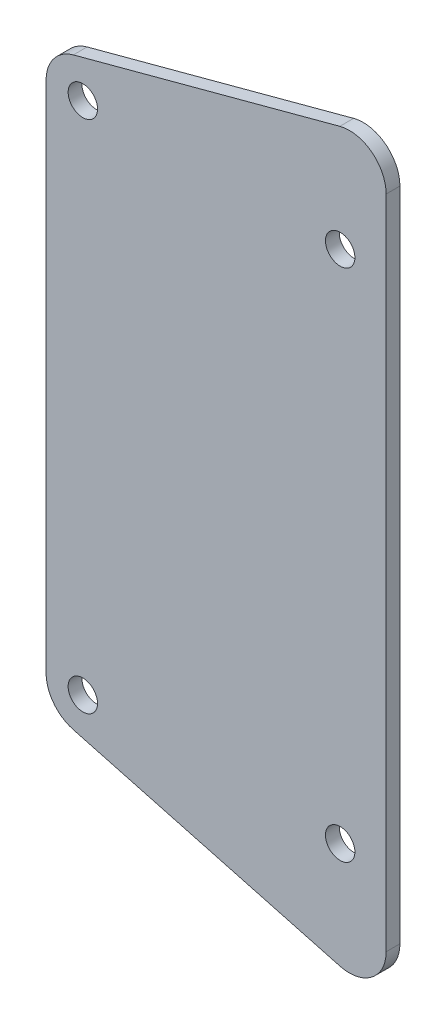
ISO-10303-21;
HEADER;
FILE_DESCRIPTION(('STEP AP214'),'2;1');
FILE_NAME('part.step','',(''),(''),'','','');
FILE_SCHEMA(('AUTOMOTIVE_DESIGN { 1 0 10303 214 1 1 1 1 }'));
ENDSEC;
DATA;
#1=APPLICATION_CONTEXT('core data for automotive mechanical design processes');
#2=APPLICATION_PROTOCOL_DEFINITION('international standard','automotive_design',2000,#1);
#3=PRODUCT_CONTEXT('',#1,'mechanical');
#4=PRODUCT('Part','Part','',(#3));
#5=PRODUCT_RELATED_PRODUCT_CATEGORY('part','',(#4));
#6=PRODUCT_DEFINITION_FORMATION('','',#4);
#7=PRODUCT_DEFINITION_CONTEXT('part definition',#1,'design');
#8=PRODUCT_DEFINITION('design','',#6,#7);
#9=PRODUCT_DEFINITION_SHAPE('','',#8);
#10=(LENGTH_UNIT() NAMED_UNIT(*) SI_UNIT(.MILLI.,.METRE.));
#11=(NAMED_UNIT(*) PLANE_ANGLE_UNIT() SI_UNIT($,.RADIAN.));
#12=(NAMED_UNIT(*) SI_UNIT($,.STERADIAN.) SOLID_ANGLE_UNIT());
#13=UNCERTAINTY_MEASURE_WITH_UNIT(LENGTH_MEASURE(1.E-05),#10,'distance_accuracy_value','');
#14=(GEOMETRIC_REPRESENTATION_CONTEXT(3) GLOBAL_UNCERTAINTY_ASSIGNED_CONTEXT((#13)) GLOBAL_UNIT_ASSIGNED_CONTEXT((#10,
#11,#12)) REPRESENTATION_CONTEXT('',''));
#15=CARTESIAN_POINT('',(0.,0.,0.));
#16=DIRECTION('',(0.,0.,1.));
#17=DIRECTION('',(1.,0.,0.));
#18=AXIS2_PLACEMENT_3D('',#15,#16,#17);
#19=CARTESIAN_POINT('',(0.,0.,1.5));
#20=DIRECTION('',(0.,0.,-1.));
#21=DIRECTION('',(-1.,0.,0.));
#22=AXIS2_PLACEMENT_3D('',#19,#20,#21);
#23=PLANE('',#22);
#24=DIRECTION('',(-0.965925826289067,-0.258819045102525,0.));
#25=VECTOR('',#24,1.);
#26=CARTESIAN_POINT('',(-32.,59.,1.5));
#27=LINE('',#26,#25);
#28=CARTESIAN_POINT('',(-0.0352761804100973,67.5649219337431,1.5));
#29=VERTEX_POINT('',#28);
#30=CARTESIAN_POINT('',(-29.0352761804101,59.7943953532404,1.5));
#31=VERTEX_POINT('',#30);
#32=EDGE_CURVE('E102',#29,#31,#27,.T.);
#33=ORIENTED_EDGE('',*,*,#32,.T.);
#34=CARTESIAN_POINT('',(-28.,55.9306920480842,1.5));
#35=DIRECTION('',(0.,0.,-1.));
#36=DIRECTION('',(-1.,0.,0.));
#37=AXIS2_PLACEMENT_3D('',#34,#35,#36);
#38=CIRCLE('',#37,4.);
#39=CARTESIAN_POINT('',(-32.,55.9306920480842,1.5));
#40=VERTEX_POINT('',#39);
#41=EDGE_CURVE('E97',#31,#40,#38,.F.);
#42=ORIENTED_EDGE('',*,*,#41,.T.);
#43=DIRECTION('',(0.,-1.,0.));
#44=VECTOR('',#43,1.);
#45=CARTESIAN_POINT('',(-32.,56.,1.5));
#46=LINE('',#45,#44);
#47=CARTESIAN_POINT('',(-32.,0.0693079519158216,1.5));
#48=VERTEX_POINT('',#47);
#49=EDGE_CURVE('E100',#40,#48,#46,.T.);
#50=ORIENTED_EDGE('',*,*,#49,.T.);
#51=CARTESIAN_POINT('',(-28.,0.0693079519158234,1.5));
#52=DIRECTION('',(0.,0.,-1.));
#53=DIRECTION('',(-1.,0.,0.));
#54=AXIS2_PLACEMENT_3D('',#51,#52,#53);
#55=CIRCLE('',#54,4.);
#56=CARTESIAN_POINT('',(-29.0352761804101,-3.79439535324044,1.5));
#57=VERTEX_POINT('',#56);
#58=EDGE_CURVE('E55',#48,#57,#55,.F.);
#59=ORIENTED_EDGE('',*,*,#58,.T.);
#60=DIRECTION('',(0.965925826289067,-0.258819045102525,0.));
#61=VECTOR('',#60,1.);
#62=CARTESIAN_POINT('',(-32.,-3.,1.5));
#63=LINE('',#62,#61);
#64=CARTESIAN_POINT('',(-0.0352761804101043,-11.5649219337431,1.5));
#65=VERTEX_POINT('',#64);
#66=EDGE_CURVE('E190',#57,#65,#63,.T.);
#67=ORIENTED_EDGE('',*,*,#66,.T.);
#68=CARTESIAN_POINT('',(0.999999999999997,-7.70121862858688,1.5));
#69=DIRECTION('',(0.,0.,-1.));
#70=DIRECTION('',(-1.,0.,0.));
#71=AXIS2_PLACEMENT_3D('',#68,#69,#70);
#72=CIRCLE('',#71,4.);
#73=CARTESIAN_POINT('',(5.,-7.70121862858688,1.5));
#74=VERTEX_POINT('',#73);
#75=EDGE_CURVE('E47',#65,#74,#72,.F.);
#76=ORIENTED_EDGE('',*,*,#75,.T.);
#77=DIRECTION('',(0.,1.,0.));
#78=VECTOR('',#77,1.);
#79=CARTESIAN_POINT('',(5.,59.,1.5));
#80=LINE('',#79,#78);
#81=CARTESIAN_POINT('',(5.,63.7012186285869,1.5));
#82=VERTEX_POINT('',#81);
#83=EDGE_CURVE('E117',#74,#82,#80,.T.);
#84=ORIENTED_EDGE('',*,*,#83,.T.);
#85=CARTESIAN_POINT('',(1.,63.7012186285869,1.5));
#86=DIRECTION('',(0.,0.,-1.));
#87=DIRECTION('',(-1.,0.,0.));
#88=AXIS2_PLACEMENT_3D('',#85,#86,#87);
#89=CIRCLE('',#88,4.);
#90=EDGE_CURVE('E136',#82,#29,#89,.F.);
#91=ORIENTED_EDGE('',*,*,#90,.T.);
#92=EDGE_LOOP('',(#33,#42,#50,#59,#67,#76,#84,#91));
#93=FACE_BOUND('',#92,.T.);
#94=CARTESIAN_POINT('',(0.,0.,1.5));
#95=DIRECTION('',(0.,0.,1.));
#96=DIRECTION('',(1.,0.,0.));
#97=AXIS2_PLACEMENT_3D('',#94,#95,#96);
#98=CIRCLE('',#97,1.6);
#99=CARTESIAN_POINT('',(1.6,0.,1.5));
#100=VERTEX_POINT('',#99);
#101=EDGE_CURVE('E159',#100,#100,#98,.T.);
#102=ORIENTED_EDGE('',*,*,#101,.F.);
#103=EDGE_LOOP('',(#102));
#104=FACE_BOUND('',#103,.T.);
#105=CARTESIAN_POINT('',(-28.,0.,1.5));
#106=DIRECTION('',(0.,0.,1.));
#107=DIRECTION('',(1.,0.,0.));
#108=AXIS2_PLACEMENT_3D('',#105,#106,#107);
#109=CIRCLE('',#108,1.6);
#110=CARTESIAN_POINT('',(-26.4,0.,1.5));
#111=VERTEX_POINT('',#110);
#112=EDGE_CURVE('E164',#111,#111,#109,.T.);
#113=ORIENTED_EDGE('',*,*,#112,.F.);
#114=EDGE_LOOP('',(#113));
#115=FACE_BOUND('',#114,.T.);
#116=CARTESIAN_POINT('',(0.,56.,1.5));
#117=DIRECTION('',(0.,0.,1.));
#118=DIRECTION('',(1.,0.,0.));
#119=AXIS2_PLACEMENT_3D('',#116,#117,#118);
#120=CIRCLE('',#119,1.6);
#121=CARTESIAN_POINT('',(1.6,56.,1.5));
#122=VERTEX_POINT('',#121);
#123=EDGE_CURVE('E169',#122,#122,#120,.T.);
#124=ORIENTED_EDGE('',*,*,#123,.F.);
#125=EDGE_LOOP('',(#124));
#126=FACE_BOUND('',#125,.T.);
#127=CARTESIAN_POINT('',(-28.,56.,1.5));
#128=DIRECTION('',(0.,0.,1.));
#129=DIRECTION('',(1.,0.,0.));
#130=AXIS2_PLACEMENT_3D('',#127,#128,#129);
#131=CIRCLE('',#130,1.6);
#132=CARTESIAN_POINT('',(-26.4,56.,1.5));
#133=VERTEX_POINT('',#132);
#134=EDGE_CURVE('E175',#133,#133,#131,.T.);
#135=ORIENTED_EDGE('',*,*,#134,.F.);
#136=EDGE_LOOP('',(#135));
#137=FACE_BOUND('',#136,.T.);
#138=ADVANCED_FACE('F32',(#93,#104,#115,#126,#137),#23,.F.);
#139=CARTESIAN_POINT('',(0.,0.,0.));
#140=DIRECTION('',(0.,0.,-1.));
#141=DIRECTION('',(-1.,0.,0.));
#142=AXIS2_PLACEMENT_3D('',#139,#140,#141);
#143=PLANE('',#142);
#144=DIRECTION('',(0.,-1.,0.));
#145=VECTOR('',#144,1.);
#146=CARTESIAN_POINT('',(-32.,0.,0.));
#147=LINE('',#146,#145);
#148=CARTESIAN_POINT('',(-32.,55.9306920480842,0.));
#149=VERTEX_POINT('',#148);
#150=CARTESIAN_POINT('',(-32.,0.0693079519158234,0.));
#151=VERTEX_POINT('',#150);
#152=EDGE_CURVE('E153',#149,#151,#147,.T.);
#153=ORIENTED_EDGE('',*,*,#152,.F.);
#154=CARTESIAN_POINT('',(-28.,55.9306920480842,0.));
#155=DIRECTION('',(0.,0.,-1.));
#156=DIRECTION('',(-1.,0.,0.));
#157=AXIS2_PLACEMENT_3D('',#154,#155,#156);
#158=CIRCLE('',#157,4.);
#159=CARTESIAN_POINT('',(-29.0352761804101,59.7943953532404,0.));
#160=VERTEX_POINT('',#159);
#161=EDGE_CURVE('E120',#149,#160,#158,.T.);
#162=ORIENTED_EDGE('',*,*,#161,.T.);
#163=DIRECTION('',(-0.965925826289067,-0.258819045102525,0.));
#164=VECTOR('',#163,1.);
#165=CARTESIAN_POINT('',(-32.,59.,0.));
#166=LINE('',#165,#164);
#167=CARTESIAN_POINT('',(-0.0352761804100973,67.5649219337431,0.));
#168=VERTEX_POINT('',#167);
#169=EDGE_CURVE('E181',#168,#160,#166,.T.);
#170=ORIENTED_EDGE('',*,*,#169,.F.);
#171=CARTESIAN_POINT('',(1.,63.7012186285869,0.));
#172=DIRECTION('',(0.,0.,-1.));
#173=DIRECTION('',(-1.,0.,0.));
#174=AXIS2_PLACEMENT_3D('',#171,#172,#173);
#175=CIRCLE('',#174,4.);
#176=CARTESIAN_POINT('',(5.,63.7012186285869,0.));
#177=VERTEX_POINT('',#176);
#178=EDGE_CURVE('E121',#168,#177,#175,.T.);
#179=ORIENTED_EDGE('',*,*,#178,.T.);
#180=DIRECTION('',(0.,1.,0.));
#181=VECTOR('',#180,1.);
#182=CARTESIAN_POINT('',(5.,59.,0.));
#183=LINE('',#182,#181);
#184=CARTESIAN_POINT('',(5.,-7.70121862858688,0.));
#185=VERTEX_POINT('',#184);
#186=EDGE_CURVE('E150',#185,#177,#183,.T.);
#187=ORIENTED_EDGE('',*,*,#186,.F.);
#188=CARTESIAN_POINT('',(0.999999999999997,-7.70121862858688,0.));
#189=DIRECTION('',(0.,0.,-1.));
#190=DIRECTION('',(-1.,0.,0.));
#191=AXIS2_PLACEMENT_3D('',#188,#189,#190);
#192=CIRCLE('',#191,4.);
#193=CARTESIAN_POINT('',(-0.0352761804100904,-11.5649219337432,0.));
#194=VERTEX_POINT('',#193);
#195=EDGE_CURVE('E123',#185,#194,#192,.T.);
#196=ORIENTED_EDGE('',*,*,#195,.T.);
#197=DIRECTION('',(0.965925826289067,-0.258819045102525,0.));
#198=VECTOR('',#197,1.);
#199=CARTESIAN_POINT('',(-32.,-3.,0.));
#200=LINE('',#199,#198);
#201=CARTESIAN_POINT('',(-29.0352761804101,-3.79439535324044,0.));
#202=VERTEX_POINT('',#201);
#203=EDGE_CURVE('E187',#202,#194,#200,.T.);
#204=ORIENTED_EDGE('',*,*,#203,.F.);
#205=CARTESIAN_POINT('',(-28.,0.0693079519158234,0.));
#206=DIRECTION('',(0.,0.,-1.));
#207=DIRECTION('',(-1.,0.,0.));
#208=AXIS2_PLACEMENT_3D('',#205,#206,#207);
#209=CIRCLE('',#208,4.);
#210=EDGE_CURVE('E129',#202,#151,#209,.T.);
#211=ORIENTED_EDGE('',*,*,#210,.T.);
#212=EDGE_LOOP('',(#153,#162,#170,#179,#187,#196,#204,#211));
#213=FACE_BOUND('',#212,.T.);
#214=CARTESIAN_POINT('',(0.,56.,0.));
#215=DIRECTION('',(0.,0.,1.));
#216=DIRECTION('',(1.,0.,0.));
#217=AXIS2_PLACEMENT_3D('',#214,#215,#216);
#218=CIRCLE('',#217,1.6);
#219=CARTESIAN_POINT('',(1.6,56.,0.));
#220=VERTEX_POINT('',#219);
#221=EDGE_CURVE('E172',#220,#220,#218,.T.);
#222=ORIENTED_EDGE('',*,*,#221,.T.);
#223=EDGE_LOOP('',(#222));
#224=FACE_BOUND('',#223,.T.);
#225=CARTESIAN_POINT('',(0.,0.,0.));
#226=DIRECTION('',(0.,0.,1.));
#227=DIRECTION('',(1.,0.,0.));
#228=AXIS2_PLACEMENT_3D('',#225,#226,#227);
#229=CIRCLE('',#228,1.6);
#230=CARTESIAN_POINT('',(1.6,0.,0.));
#231=VERTEX_POINT('',#230);
#232=EDGE_CURVE('E156',#231,#231,#229,.T.);
#233=ORIENTED_EDGE('',*,*,#232,.T.);
#234=EDGE_LOOP('',(#233));
#235=FACE_BOUND('',#234,.T.);
#236=CARTESIAN_POINT('',(-28.,0.,0.));
#237=DIRECTION('',(0.,0.,1.));
#238=DIRECTION('',(1.,0.,0.));
#239=AXIS2_PLACEMENT_3D('',#236,#237,#238);
#240=CIRCLE('',#239,1.6);
#241=CARTESIAN_POINT('',(-26.4,0.,0.));
#242=VERTEX_POINT('',#241);
#243=EDGE_CURVE('E166',#242,#242,#240,.T.);
#244=ORIENTED_EDGE('',*,*,#243,.T.);
#245=EDGE_LOOP('',(#244));
#246=FACE_BOUND('',#245,.T.);
#247=CARTESIAN_POINT('',(-28.,56.,0.));
#248=DIRECTION('',(0.,0.,1.));
#249=DIRECTION('',(1.,0.,0.));
#250=AXIS2_PLACEMENT_3D('',#247,#248,#249);
#251=CIRCLE('',#250,1.6);
#252=CARTESIAN_POINT('',(-26.4,56.,0.));
#253=VERTEX_POINT('',#252);
#254=EDGE_CURVE('E178',#253,#253,#251,.T.);
#255=ORIENTED_EDGE('',*,*,#254,.T.);
#256=EDGE_LOOP('',(#255));
#257=FACE_BOUND('',#256,.T.);
#258=ADVANCED_FACE('F199',(#213,#224,#235,#246,#257),#143,.T.);
#259=CARTESIAN_POINT('',(5.,59.,1.5));
#260=DIRECTION('',(-1.,0.,0.));
#261=DIRECTION('',(0.,0.,1.));
#262=AXIS2_PLACEMENT_3D('',#259,#260,#261);
#263=PLANE('',#262);
#264=ORIENTED_EDGE('',*,*,#83,.F.);
#265=DIRECTION('',(0.,0.,1.));
#266=VECTOR('',#265,1.);
#267=CARTESIAN_POINT('',(5.,-7.70121862858688,0.));
#268=LINE('',#267,#266);
#269=EDGE_CURVE('E11',#74,#185,#268,.F.);
#270=ORIENTED_EDGE('',*,*,#269,.T.);
#271=ORIENTED_EDGE('',*,*,#186,.T.);
#272=DIRECTION('',(0.,0.,1.));
#273=VECTOR('',#272,1.);
#274=CARTESIAN_POINT('',(5.,63.7012186285869,1.5));
#275=LINE('',#274,#273);
#276=EDGE_CURVE('E40',#177,#82,#275,.T.);
#277=ORIENTED_EDGE('',*,*,#276,.T.);
#278=EDGE_LOOP('',(#264,#270,#271,#277));
#279=FACE_BOUND('',#278,.T.);
#280=ADVANCED_FACE('F148',(#279),#263,.F.);
#281=CARTESIAN_POINT('',(-32.,0.,1.5));
#282=DIRECTION('',(1.,0.,0.));
#283=DIRECTION('',(0.,0.,-1.));
#284=AXIS2_PLACEMENT_3D('',#281,#282,#283);
#285=PLANE('',#284);
#286=ORIENTED_EDGE('',*,*,#49,.F.);
#287=DIRECTION('',(0.,0.,-1.));
#288=VECTOR('',#287,1.);
#289=CARTESIAN_POINT('',(-32.,55.9306920480842,0.));
#290=LINE('',#289,#288);
#291=EDGE_CURVE('E113',#40,#149,#290,.T.);
#292=ORIENTED_EDGE('',*,*,#291,.T.);
#293=ORIENTED_EDGE('',*,*,#152,.T.);
#294=DIRECTION('',(0.,0.,1.));
#295=VECTOR('',#294,1.);
#296=CARTESIAN_POINT('',(-32.,0.0693079519158234,1.5));
#297=LINE('',#296,#295);
#298=EDGE_CURVE('E116',#151,#48,#297,.T.);
#299=ORIENTED_EDGE('',*,*,#298,.T.);
#300=EDGE_LOOP('',(#286,#292,#293,#299));
#301=FACE_BOUND('',#300,.T.);
#302=ADVANCED_FACE('F111',(#301),#285,.F.);
#303=CARTESIAN_POINT('',(0.,0.,1.5));
#304=DIRECTION('',(0.,0.,-1.));
#305=DIRECTION('',(-1.,0.,0.));
#306=AXIS2_PLACEMENT_3D('',#303,#304,#305);
#307=CYLINDRICAL_SURFACE('',#306,1.6);
#308=ORIENTED_EDGE('',*,*,#101,.T.);
#309=EDGE_LOOP('',(#308));
#310=FACE_BOUND('',#309,.T.);
#311=ORIENTED_EDGE('',*,*,#232,.F.);
#312=EDGE_LOOP('',(#311));
#313=FACE_BOUND('',#312,.T.);
#314=ADVANCED_FACE('F226',(#310,#313),#307,.F.);
#315=CARTESIAN_POINT('',(-28.,0.,1.5));
#316=DIRECTION('',(0.,0.,-1.));
#317=DIRECTION('',(-1.,0.,0.));
#318=AXIS2_PLACEMENT_3D('',#315,#316,#317);
#319=CYLINDRICAL_SURFACE('',#318,1.6);
#320=ORIENTED_EDGE('',*,*,#112,.T.);
#321=EDGE_LOOP('',(#320));
#322=FACE_BOUND('',#321,.T.);
#323=ORIENTED_EDGE('',*,*,#243,.F.);
#324=EDGE_LOOP('',(#323));
#325=FACE_BOUND('',#324,.T.);
#326=ADVANCED_FACE('F306',(#322,#325),#319,.F.);
#327=CARTESIAN_POINT('',(0.,56.,1.5));
#328=DIRECTION('',(0.,0.,-1.));
#329=DIRECTION('',(-1.,0.,0.));
#330=AXIS2_PLACEMENT_3D('',#327,#328,#329);
#331=CYLINDRICAL_SURFACE('',#330,1.6);
#332=ORIENTED_EDGE('',*,*,#123,.T.);
#333=EDGE_LOOP('',(#332));
#334=FACE_BOUND('',#333,.T.);
#335=ORIENTED_EDGE('',*,*,#221,.F.);
#336=EDGE_LOOP('',(#335));
#337=FACE_BOUND('',#336,.T.);
#338=ADVANCED_FACE('F216',(#334,#337),#331,.F.);
#339=CARTESIAN_POINT('',(-28.,56.,1.5));
#340=DIRECTION('',(0.,0.,-1.));
#341=DIRECTION('',(-1.,0.,0.));
#342=AXIS2_PLACEMENT_3D('',#339,#340,#341);
#343=CYLINDRICAL_SURFACE('',#342,1.6);
#344=ORIENTED_EDGE('',*,*,#134,.T.);
#345=EDGE_LOOP('',(#344));
#346=FACE_BOUND('',#345,.T.);
#347=ORIENTED_EDGE('',*,*,#254,.F.);
#348=EDGE_LOOP('',(#347));
#349=FACE_BOUND('',#348,.T.);
#350=ADVANCED_FACE('F208',(#346,#349),#343,.F.);
#351=CARTESIAN_POINT('',(-32.,59.,-38.3052186751731));
#352=DIRECTION('',(-0.258819045102525,0.965925826289067,0.));
#353=DIRECTION('',(-0.965925826289067,-0.258819045102525,0.));
#354=AXIS2_PLACEMENT_3D('',#351,#352,#353);
#355=PLANE('',#354);
#356=ORIENTED_EDGE('',*,*,#169,.T.);
#357=DIRECTION('',(0.,0.,-1.));
#358=VECTOR('',#357,1.);
#359=CARTESIAN_POINT('',(-29.0352761804101,59.7943953532404,1.5));
#360=LINE('',#359,#358);
#361=EDGE_CURVE('E134',#160,#31,#360,.F.);
#362=ORIENTED_EDGE('',*,*,#361,.T.);
#363=ORIENTED_EDGE('',*,*,#32,.F.);
#364=DIRECTION('',(0.,0.,1.));
#365=VECTOR('',#364,1.);
#366=CARTESIAN_POINT('',(-0.0352761804101032,67.5649219337431,0.));
#367=LINE('',#366,#365);
#368=EDGE_CURVE('E132',#29,#168,#367,.F.);
#369=ORIENTED_EDGE('',*,*,#368,.T.);
#370=EDGE_LOOP('',(#356,#362,#363,#369));
#371=FACE_BOUND('',#370,.T.);
#372=ADVANCED_FACE('F206',(#371),#355,.T.);
#373=CARTESIAN_POINT('',(-32.,-3.,-38.3052186751731));
#374=DIRECTION('',(-0.258819045102525,-0.965925826289067,0.));
#375=DIRECTION('',(0.965925826289067,-0.258819045102525,0.));
#376=AXIS2_PLACEMENT_3D('',#373,#374,#375);
#377=PLANE('',#376);
#378=ORIENTED_EDGE('',*,*,#66,.F.);
#379=DIRECTION('',(0.,0.,1.));
#380=VECTOR('',#379,1.);
#381=CARTESIAN_POINT('',(-29.0352761804101,-3.79439535324044,0.));
#382=LINE('',#381,#380);
#383=EDGE_CURVE('E141',#57,#202,#382,.F.);
#384=ORIENTED_EDGE('',*,*,#383,.T.);
#385=ORIENTED_EDGE('',*,*,#203,.T.);
#386=DIRECTION('',(0.,0.,1.));
#387=VECTOR('',#386,1.);
#388=CARTESIAN_POINT('',(-0.0352761804101041,-11.5649219337431,1.5));
#389=LINE('',#388,#387);
#390=EDGE_CURVE('E106',#194,#65,#389,.T.);
#391=ORIENTED_EDGE('',*,*,#390,.T.);
#392=EDGE_LOOP('',(#378,#384,#385,#391));
#393=FACE_BOUND('',#392,.T.);
#394=ADVANCED_FACE('F193',(#393),#377,.T.);
#395=CARTESIAN_POINT('',(-28.,55.9306920480842,1.5));
#396=DIRECTION('',(0.,0.,1.));
#397=DIRECTION('',(1.,0.,0.));
#398=AXIS2_PLACEMENT_3D('',#395,#396,#397);
#399=CYLINDRICAL_SURFACE('',#398,4.);
#400=ORIENTED_EDGE('',*,*,#41,.F.);
#401=ORIENTED_EDGE('',*,*,#361,.F.);
#402=ORIENTED_EDGE('',*,*,#161,.F.);
#403=ORIENTED_EDGE('',*,*,#291,.F.);
#404=EDGE_LOOP('',(#400,#401,#402,#403));
#405=FACE_BOUND('',#404,.T.);
#406=ADVANCED_FACE('F119',(#405),#399,.T.);
#407=CARTESIAN_POINT('',(-28.,0.0693079519158234,1.5));
#408=DIRECTION('',(0.,0.,-1.));
#409=DIRECTION('',(-1.,0.,0.));
#410=AXIS2_PLACEMENT_3D('',#407,#408,#409);
#411=CYLINDRICAL_SURFACE('',#410,4.);
#412=ORIENTED_EDGE('',*,*,#210,.F.);
#413=ORIENTED_EDGE('',*,*,#383,.F.);
#414=ORIENTED_EDGE('',*,*,#58,.F.);
#415=ORIENTED_EDGE('',*,*,#298,.F.);
#416=EDGE_LOOP('',(#412,#413,#414,#415));
#417=FACE_BOUND('',#416,.T.);
#418=ADVANCED_FACE('F197',(#417),#411,.T.);
#419=CARTESIAN_POINT('',(0.999999999999997,-7.70121862858688,-38.3052186751731));
#420=DIRECTION('',(0.,0.,-1.));
#421=DIRECTION('',(-1.,0.,0.));
#422=AXIS2_PLACEMENT_3D('',#419,#420,#421);
#423=CYLINDRICAL_SURFACE('',#422,4.);
#424=ORIENTED_EDGE('',*,*,#195,.F.);
#425=ORIENTED_EDGE('',*,*,#269,.F.);
#426=ORIENTED_EDGE('',*,*,#75,.F.);
#427=ORIENTED_EDGE('',*,*,#390,.F.);
#428=EDGE_LOOP('',(#424,#425,#426,#427));
#429=FACE_BOUND('',#428,.T.);
#430=ADVANCED_FACE('F202',(#429),#423,.T.);
#431=CARTESIAN_POINT('',(1.,63.7012186285869,1.5));
#432=DIRECTION('',(0.,0.,-1.));
#433=DIRECTION('',(-1.,0.,0.));
#434=AXIS2_PLACEMENT_3D('',#431,#432,#433);
#435=CYLINDRICAL_SURFACE('',#434,4.);
#436=ORIENTED_EDGE('',*,*,#178,.F.);
#437=ORIENTED_EDGE('',*,*,#368,.F.);
#438=ORIENTED_EDGE('',*,*,#90,.F.);
#439=ORIENTED_EDGE('',*,*,#276,.F.);
#440=EDGE_LOOP('',(#436,#437,#438,#439));
#441=FACE_BOUND('',#440,.T.);
#442=ADVANCED_FACE('F34',(#441),#435,.T.);
#443=CLOSED_SHELL('',(#138,#258,#280,#302,#314,#326,#338,#350,#372,#394,#406,#418,#430,#442));
#444=MANIFOLD_SOLID_BREP('B2',#443);
#445=ADVANCED_BREP_SHAPE_REPRESENTATION('',(#18,#444),#14);
#446=SHAPE_DEFINITION_REPRESENTATION(#9,#445);
ENDSEC;
END-ISO-10303-21;
